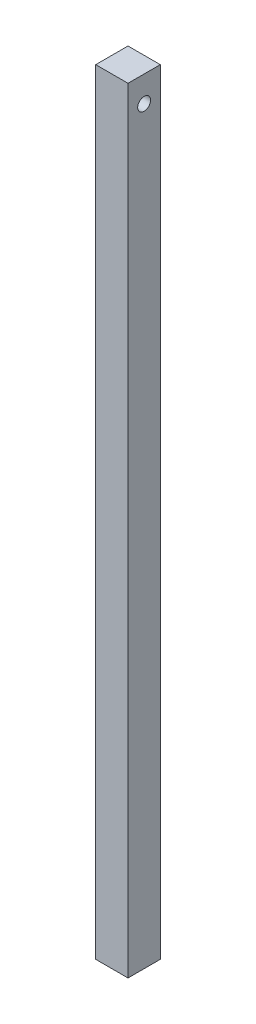
ISO-10303-21;
HEADER;
FILE_DESCRIPTION(('STEP AP214'),'2;1');
FILE_NAME('part.step','',(''),(''),'','','');
FILE_SCHEMA(('AUTOMOTIVE_DESIGN { 1 0 10303 214 1 1 1 1 }'));
ENDSEC;
DATA;
#1=APPLICATION_CONTEXT('core data for automotive mechanical design processes');
#2=APPLICATION_PROTOCOL_DEFINITION('international standard','automotive_design',2000,#1);
#3=PRODUCT_CONTEXT('',#1,'mechanical');
#4=PRODUCT('Part','Part','',(#3));
#5=PRODUCT_RELATED_PRODUCT_CATEGORY('part','',(#4));
#6=PRODUCT_DEFINITION_FORMATION('','',#4);
#7=PRODUCT_DEFINITION_CONTEXT('part definition',#1,'design');
#8=PRODUCT_DEFINITION('design','',#6,#7);
#9=PRODUCT_DEFINITION_SHAPE('','',#8);
#10=(LENGTH_UNIT() NAMED_UNIT(*) SI_UNIT(.MILLI.,.METRE.));
#11=(NAMED_UNIT(*) PLANE_ANGLE_UNIT() SI_UNIT($,.RADIAN.));
#12=(NAMED_UNIT(*) SI_UNIT($,.STERADIAN.) SOLID_ANGLE_UNIT());
#13=UNCERTAINTY_MEASURE_WITH_UNIT(LENGTH_MEASURE(1.E-05),#10,'distance_accuracy_value','');
#14=(GEOMETRIC_REPRESENTATION_CONTEXT(3) GLOBAL_UNCERTAINTY_ASSIGNED_CONTEXT((#13)) GLOBAL_UNIT_ASSIGNED_CONTEXT((#10,
#11,#12)) REPRESENTATION_CONTEXT('',''));
#15=CARTESIAN_POINT('',(0.,0.,0.));
#16=DIRECTION('',(0.,0.,1.));
#17=DIRECTION('',(1.,0.,0.));
#18=AXIS2_PLACEMENT_3D('',#15,#16,#17);
#19=CARTESIAN_POINT('',(-12.5,-100.,12.5));
#20=DIRECTION('',(-1.,0.,0.));
#21=DIRECTION('',(0.,0.,1.));
#22=AXIS2_PLACEMENT_3D('',#19,#20,#21);
#23=PLANE('',#22);
#24=CARTESIAN_POINT('',(-12.5,480.,0.));
#25=DIRECTION('',(-1.,0.,0.));
#26=DIRECTION('',(0.,0.,1.));
#27=AXIS2_PLACEMENT_3D('',#24,#25,#26);
#28=CIRCLE('',#27,5.);
#29=CARTESIAN_POINT('',(-12.5,480.,5.));
#30=VERTEX_POINT('',#29);
#31=EDGE_CURVE('E94',#30,#30,#28,.T.);
#32=ORIENTED_EDGE('',*,*,#31,.F.);
#33=EDGE_LOOP('',(#32));
#34=FACE_BOUND('',#33,.T.);
#35=DIRECTION('',(0.,1.,0.));
#36=VECTOR('',#35,1.);
#37=CARTESIAN_POINT('',(-12.5,-100.,12.5));
#38=LINE('',#37,#36);
#39=CARTESIAN_POINT('',(-12.5,-100.,12.5));
#40=VERTEX_POINT('',#39);
#41=CARTESIAN_POINT('',(-12.5,500.,12.5));
#42=VERTEX_POINT('',#41);
#43=EDGE_CURVE('E71',#40,#42,#38,.T.);
#44=ORIENTED_EDGE('',*,*,#43,.T.);
#45=DIRECTION('',(0.,0.,1.));
#46=VECTOR('',#45,1.);
#47=CARTESIAN_POINT('',(-12.5,500.,12.5));
#48=LINE('',#47,#46);
#49=CARTESIAN_POINT('',(-12.5,500.,-12.5));
#50=VERTEX_POINT('',#49);
#51=EDGE_CURVE('E74',#50,#42,#48,.T.);
#52=ORIENTED_EDGE('',*,*,#51,.F.);
#53=DIRECTION('',(0.,1.,0.));
#54=VECTOR('',#53,1.);
#55=CARTESIAN_POINT('',(-12.5,-100.,-12.5));
#56=LINE('',#55,#54);
#57=CARTESIAN_POINT('',(-12.5,-100.,-12.5));
#58=VERTEX_POINT('',#57);
#59=EDGE_CURVE('E11',#58,#50,#56,.T.);
#60=ORIENTED_EDGE('',*,*,#59,.F.);
#61=DIRECTION('',(0.,0.,1.));
#62=VECTOR('',#61,1.);
#63=CARTESIAN_POINT('',(-12.5,-100.,12.5));
#64=LINE('',#63,#62);
#65=EDGE_CURVE('E75',#58,#40,#64,.T.);
#66=ORIENTED_EDGE('',*,*,#65,.T.);
#67=EDGE_LOOP('',(#44,#52,#60,#66));
#68=FACE_BOUND('',#67,.T.);
#69=ADVANCED_FACE('F33',(#34,#68),#23,.T.);
#70=CARTESIAN_POINT('',(12.5,-100.,-12.5));
#71=DIRECTION('',(0.,0.,-1.));
#72=DIRECTION('',(-1.,0.,0.));
#73=AXIS2_PLACEMENT_3D('',#70,#71,#72);
#74=PLANE('',#73);
#75=ORIENTED_EDGE('',*,*,#59,.T.);
#76=DIRECTION('',(-1.,0.,0.));
#77=VECTOR('',#76,1.);
#78=CARTESIAN_POINT('',(12.5,500.,-12.5));
#79=LINE('',#78,#77);
#80=CARTESIAN_POINT('',(12.5,500.,-12.5));
#81=VERTEX_POINT('',#80);
#82=EDGE_CURVE('E91',#81,#50,#79,.T.);
#83=ORIENTED_EDGE('',*,*,#82,.F.);
#84=DIRECTION('',(0.,1.,0.));
#85=VECTOR('',#84,1.);
#86=CARTESIAN_POINT('',(12.5,-100.,-12.5));
#87=LINE('',#86,#85);
#88=CARTESIAN_POINT('',(12.5,-100.,-12.5));
#89=VERTEX_POINT('',#88);
#90=EDGE_CURVE('E41',#89,#81,#87,.T.);
#91=ORIENTED_EDGE('',*,*,#90,.F.);
#92=DIRECTION('',(-1.,0.,0.));
#93=VECTOR('',#92,1.);
#94=CARTESIAN_POINT('',(12.5,-100.,-12.5));
#95=LINE('',#94,#93);
#96=EDGE_CURVE('E80',#89,#58,#95,.T.);
#97=ORIENTED_EDGE('',*,*,#96,.T.);
#98=EDGE_LOOP('',(#75,#83,#91,#97));
#99=FACE_BOUND('',#98,.T.);
#100=ADVANCED_FACE('F110',(#99),#74,.T.);
#101=CARTESIAN_POINT('',(12.5,-100.,12.5));
#102=DIRECTION('',(1.,0.,0.));
#103=DIRECTION('',(0.,0.,-1.));
#104=AXIS2_PLACEMENT_3D('',#101,#102,#103);
#105=PLANE('',#104);
#106=CARTESIAN_POINT('',(12.5,480.,0.));
#107=DIRECTION('',(1.,0.,0.));
#108=DIRECTION('',(0.,0.,-1.));
#109=AXIS2_PLACEMENT_3D('',#106,#107,#108);
#110=CIRCLE('',#109,5.);
#111=CARTESIAN_POINT('',(12.5,480.,-5.));
#112=VERTEX_POINT('',#111);
#113=EDGE_CURVE('E36',#112,#112,#110,.T.);
#114=ORIENTED_EDGE('',*,*,#113,.F.);
#115=EDGE_LOOP('',(#114));
#116=FACE_BOUND('',#115,.T.);
#117=ORIENTED_EDGE('',*,*,#90,.T.);
#118=DIRECTION('',(0.,0.,-1.));
#119=VECTOR('',#118,1.);
#120=CARTESIAN_POINT('',(12.5,500.,12.5));
#121=LINE('',#120,#119);
#122=CARTESIAN_POINT('',(12.5,500.,12.5));
#123=VERTEX_POINT('',#122);
#124=EDGE_CURVE('E87',#123,#81,#121,.T.);
#125=ORIENTED_EDGE('',*,*,#124,.F.);
#126=DIRECTION('',(0.,1.,0.));
#127=VECTOR('',#126,1.);
#128=CARTESIAN_POINT('',(12.5,-100.,12.5));
#129=LINE('',#128,#127);
#130=CARTESIAN_POINT('',(12.5,-100.,12.5));
#131=VERTEX_POINT('',#130);
#132=EDGE_CURVE('E79',#131,#123,#129,.T.);
#133=ORIENTED_EDGE('',*,*,#132,.F.);
#134=DIRECTION('',(0.,0.,-1.));
#135=VECTOR('',#134,1.);
#136=CARTESIAN_POINT('',(12.5,-100.,12.5));
#137=LINE('',#136,#135);
#138=EDGE_CURVE('E102',#131,#89,#137,.T.);
#139=ORIENTED_EDGE('',*,*,#138,.T.);
#140=EDGE_LOOP('',(#117,#125,#133,#139));
#141=FACE_BOUND('',#140,.T.);
#142=ADVANCED_FACE('F107',(#116,#141),#105,.T.);
#143=CARTESIAN_POINT('',(12.5,-100.,12.5));
#144=DIRECTION('',(0.,0.,1.));
#145=DIRECTION('',(1.,0.,0.));
#146=AXIS2_PLACEMENT_3D('',#143,#144,#145);
#147=PLANE('',#146);
#148=ORIENTED_EDGE('',*,*,#132,.T.);
#149=DIRECTION('',(1.,0.,0.));
#150=VECTOR('',#149,1.);
#151=CARTESIAN_POINT('',(12.5,500.,12.5));
#152=LINE('',#151,#150);
#153=EDGE_CURVE('E82',#42,#123,#152,.T.);
#154=ORIENTED_EDGE('',*,*,#153,.F.);
#155=ORIENTED_EDGE('',*,*,#43,.F.);
#156=DIRECTION('',(1.,0.,0.));
#157=VECTOR('',#156,1.);
#158=CARTESIAN_POINT('',(12.5,-100.,12.5));
#159=LINE('',#158,#157);
#160=EDGE_CURVE('E100',#40,#131,#159,.T.);
#161=ORIENTED_EDGE('',*,*,#160,.T.);
#162=EDGE_LOOP('',(#148,#154,#155,#161));
#163=FACE_BOUND('',#162,.T.);
#164=ADVANCED_FACE('F83',(#163),#147,.T.);
#165=CARTESIAN_POINT('',(0.,-100.,0.));
#166=DIRECTION('',(0.,1.,0.));
#167=DIRECTION('',(0.,0.,1.));
#168=AXIS2_PLACEMENT_3D('',#165,#166,#167);
#169=PLANE('',#168);
#170=ORIENTED_EDGE('',*,*,#65,.F.);
#171=ORIENTED_EDGE('',*,*,#96,.F.);
#172=ORIENTED_EDGE('',*,*,#138,.F.);
#173=ORIENTED_EDGE('',*,*,#160,.F.);
#174=EDGE_LOOP('',(#170,#171,#172,#173));
#175=FACE_BOUND('',#174,.T.);
#176=ADVANCED_FACE('F112',(#175),#169,.F.);
#177=CARTESIAN_POINT('',(0.,500.,0.));
#178=DIRECTION('',(0.,1.,0.));
#179=DIRECTION('',(0.,0.,1.));
#180=AXIS2_PLACEMENT_3D('',#177,#178,#179);
#181=PLANE('',#180);
#182=ORIENTED_EDGE('',*,*,#51,.T.);
#183=ORIENTED_EDGE('',*,*,#153,.T.);
#184=ORIENTED_EDGE('',*,*,#124,.T.);
#185=ORIENTED_EDGE('',*,*,#82,.T.);
#186=EDGE_LOOP('',(#182,#183,#184,#185));
#187=FACE_BOUND('',#186,.T.);
#188=ADVANCED_FACE('F90',(#187),#181,.T.);
#189=CARTESIAN_POINT('',(487.5,480.,0.));
#190=DIRECTION('',(-1.,0.,0.));
#191=DIRECTION('',(0.,0.,1.));
#192=AXIS2_PLACEMENT_3D('',#189,#190,#191);
#193=CYLINDRICAL_SURFACE('',#192,5.);
#194=ORIENTED_EDGE('',*,*,#113,.T.);
#195=EDGE_LOOP('',(#194));
#196=FACE_BOUND('',#195,.T.);
#197=ORIENTED_EDGE('',*,*,#31,.T.);
#198=EDGE_LOOP('',(#197));
#199=FACE_BOUND('',#198,.T.);
#200=ADVANCED_FACE('F119',(#196,#199),#193,.F.);
#201=CLOSED_SHELL('',(#69,#100,#142,#164,#176,#188,#200));
#202=MANIFOLD_SOLID_BREP('B2',#201);
#203=ADVANCED_BREP_SHAPE_REPRESENTATION('',(#18,#202),#14);
#204=SHAPE_DEFINITION_REPRESENTATION(#9,#203);
ENDSEC;
END-ISO-10303-21;
